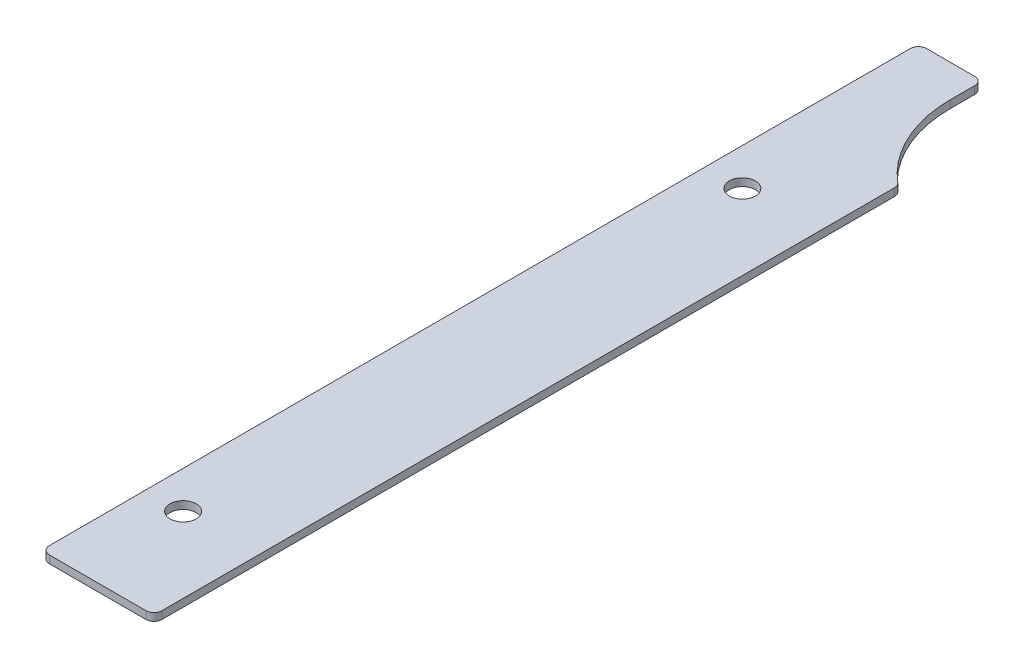
ISO-10303-21;
HEADER;
FILE_DESCRIPTION(('STEP AP214'),'2;1');
FILE_NAME('part.step','',(''),(''),'','','');
FILE_SCHEMA(('AUTOMOTIVE_DESIGN { 1 0 10303 214 1 1 1 1 }'));
ENDSEC;
DATA;
#1=APPLICATION_CONTEXT('core data for automotive mechanical design processes');
#2=APPLICATION_PROTOCOL_DEFINITION('international standard','automotive_design',2000,#1);
#3=PRODUCT_CONTEXT('',#1,'mechanical');
#4=PRODUCT('Part','Part','',(#3));
#5=PRODUCT_RELATED_PRODUCT_CATEGORY('part','',(#4));
#6=PRODUCT_DEFINITION_FORMATION('','',#4);
#7=PRODUCT_DEFINITION_CONTEXT('part definition',#1,'design');
#8=PRODUCT_DEFINITION('design','',#6,#7);
#9=PRODUCT_DEFINITION_SHAPE('','',#8);
#10=(LENGTH_UNIT() NAMED_UNIT(*) SI_UNIT(.MILLI.,.METRE.));
#11=(NAMED_UNIT(*) PLANE_ANGLE_UNIT() SI_UNIT($,.RADIAN.));
#12=(NAMED_UNIT(*) SI_UNIT($,.STERADIAN.) SOLID_ANGLE_UNIT());
#13=UNCERTAINTY_MEASURE_WITH_UNIT(LENGTH_MEASURE(1.E-05),#10,'distance_accuracy_value','');
#14=(GEOMETRIC_REPRESENTATION_CONTEXT(3) GLOBAL_UNCERTAINTY_ASSIGNED_CONTEXT((#13)) GLOBAL_UNIT_ASSIGNED_CONTEXT((#10,
#11,#12)) REPRESENTATION_CONTEXT('',''));
#15=CARTESIAN_POINT('',(0.,0.,0.));
#16=DIRECTION('',(0.,0.,1.));
#17=DIRECTION('',(1.,0.,0.));
#18=AXIS2_PLACEMENT_3D('',#15,#16,#17);
#19=CARTESIAN_POINT('',(-22.225,-3.0226,173.0375));
#20=DIRECTION('',(-1.,0.,0.));
#21=DIRECTION('',(0.,0.,1.));
#22=AXIS2_PLACEMENT_3D('',#19,#20,#21);
#23=PLANE('',#22);
#24=DIRECTION('',(0.,0.,1.));
#25=VECTOR('',#24,1.);
#26=CARTESIAN_POINT('',(-22.225,0.,173.0375));
#27=LINE('',#26,#25);
#28=CARTESIAN_POINT('',(-22.225,0.,-169.8625));
#29=VERTEX_POINT('',#28);
#30=CARTESIAN_POINT('',(-22.225,0.,169.8625));
#31=VERTEX_POINT('',#30);
#32=EDGE_CURVE('E206',#29,#31,#27,.T.);
#33=ORIENTED_EDGE('',*,*,#32,.F.);
#34=DIRECTION('',(0.,1.,0.));
#35=VECTOR('',#34,1.);
#36=CARTESIAN_POINT('',(-22.225,-3.0226,-169.8625));
#37=LINE('',#36,#35);
#38=CARTESIAN_POINT('',(-22.225,-3.0226,-169.8625));
#39=VERTEX_POINT('',#38);
#40=EDGE_CURVE('E63',#29,#39,#37,.F.);
#41=ORIENTED_EDGE('',*,*,#40,.T.);
#42=DIRECTION('',(0.,0.,1.));
#43=VECTOR('',#42,1.);
#44=CARTESIAN_POINT('',(-22.225,-3.0226,173.0375));
#45=LINE('',#44,#43);
#46=CARTESIAN_POINT('',(-22.225,-3.0226,169.8625));
#47=VERTEX_POINT('',#46);
#48=EDGE_CURVE('E215',#39,#47,#45,.T.);
#49=ORIENTED_EDGE('',*,*,#48,.T.);
#50=DIRECTION('',(0.,1.,0.));
#51=VECTOR('',#50,1.);
#52=CARTESIAN_POINT('',(-22.225,-3.0226,169.8625));
#53=LINE('',#52,#51);
#54=EDGE_CURVE('E179',#47,#31,#53,.T.);
#55=ORIENTED_EDGE('',*,*,#54,.T.);
#56=EDGE_LOOP('',(#33,#41,#49,#55));
#57=FACE_BOUND('',#56,.T.);
#58=ADVANCED_FACE('F41',(#57),#23,.T.);
#59=CARTESIAN_POINT('',(22.225,-3.0226,-173.0375));
#60=DIRECTION('',(0.,0.,-1.));
#61=DIRECTION('',(-1.,0.,0.));
#62=AXIS2_PLACEMENT_3D('',#59,#60,#61);
#63=PLANE('',#62);
#64=DIRECTION('',(-1.,0.,0.));
#65=VECTOR('',#64,1.);
#66=CARTESIAN_POINT('',(22.225,0.,-173.0375));
#67=LINE('',#66,#65);
#68=CARTESIAN_POINT('',(0.,0.,-173.0375));
#69=VERTEX_POINT('',#68);
#70=CARTESIAN_POINT('',(-19.05,0.,-173.0375));
#71=VERTEX_POINT('',#70);
#72=EDGE_CURVE('E208',#69,#71,#67,.T.);
#73=ORIENTED_EDGE('',*,*,#72,.F.);
#74=DIRECTION('',(0.,1.,0.));
#75=VECTOR('',#74,1.);
#76=CARTESIAN_POINT('',(0.,-3.0226,-173.0375));
#77=LINE('',#76,#75);
#78=CARTESIAN_POINT('',(0.,-3.0226,-173.0375));
#79=VERTEX_POINT('',#78);
#80=EDGE_CURVE('E169',#69,#79,#77,.F.);
#81=ORIENTED_EDGE('',*,*,#80,.T.);
#82=DIRECTION('',(-1.,0.,0.));
#83=VECTOR('',#82,1.);
#84=CARTESIAN_POINT('',(22.225,-3.0226,-173.0375));
#85=LINE('',#84,#83);
#86=CARTESIAN_POINT('',(-19.05,-3.0226,-173.0375));
#87=VERTEX_POINT('',#86);
#88=EDGE_CURVE('E138',#79,#87,#85,.T.);
#89=ORIENTED_EDGE('',*,*,#88,.T.);
#90=DIRECTION('',(0.,1.,0.));
#91=VECTOR('',#90,1.);
#92=CARTESIAN_POINT('',(-19.05,-3.0226,-173.0375));
#93=LINE('',#92,#91);
#94=EDGE_CURVE('E166',#87,#71,#93,.T.);
#95=ORIENTED_EDGE('',*,*,#94,.T.);
#96=EDGE_LOOP('',(#73,#81,#89,#95));
#97=FACE_BOUND('',#96,.T.);
#98=ADVANCED_FACE('F227',(#97),#63,.T.);
#99=CARTESIAN_POINT('',(22.225,-3.0226,173.0375));
#100=DIRECTION('',(1.,0.,0.));
#101=DIRECTION('',(0.,0.,-1.));
#102=AXIS2_PLACEMENT_3D('',#99,#100,#101);
#103=PLANE('',#102);
#104=DIRECTION('',(0.,0.,-1.));
#105=VECTOR('',#104,1.);
#106=CARTESIAN_POINT('',(22.225,-3.0226,173.0375));
#107=LINE('',#106,#105);
#108=CARTESIAN_POINT('',(22.225,-3.0226,169.8625));
#109=VERTEX_POINT('',#108);
#110=CARTESIAN_POINT('',(22.225,-3.0226,-119.15303385494));
#111=VERTEX_POINT('',#110);
#112=EDGE_CURVE('E219',#109,#111,#107,.T.);
#113=ORIENTED_EDGE('',*,*,#112,.T.);
#114=DIRECTION('',(0.,-1.,0.));
#115=VECTOR('',#114,1.);
#116=CARTESIAN_POINT('',(22.225,0.,-119.15303385494));
#117=LINE('',#116,#115);
#118=CARTESIAN_POINT('',(22.225,0.,-119.15303385494));
#119=VERTEX_POINT('',#118);
#120=EDGE_CURVE('E185',#111,#119,#117,.F.);
#121=ORIENTED_EDGE('',*,*,#120,.T.);
#122=DIRECTION('',(0.,0.,-1.));
#123=VECTOR('',#122,1.);
#124=CARTESIAN_POINT('',(22.225,0.,173.0375));
#125=LINE('',#124,#123);
#126=CARTESIAN_POINT('',(22.225,0.,169.8625));
#127=VERTEX_POINT('',#126);
#128=EDGE_CURVE('E205',#127,#119,#125,.T.);
#129=ORIENTED_EDGE('',*,*,#128,.F.);
#130=DIRECTION('',(0.,1.,0.));
#131=VECTOR('',#130,1.);
#132=CARTESIAN_POINT('',(22.225,-3.0226,169.8625));
#133=LINE('',#132,#131);
#134=EDGE_CURVE('E183',#127,#109,#133,.F.);
#135=ORIENTED_EDGE('',*,*,#134,.T.);
#136=EDGE_LOOP('',(#113,#121,#129,#135));
#137=FACE_BOUND('',#136,.T.);
#138=ADVANCED_FACE('F237',(#137),#103,.T.);
#139=CARTESIAN_POINT('',(22.225,-3.0226,173.0375));
#140=DIRECTION('',(0.,0.,1.));
#141=DIRECTION('',(1.,0.,0.));
#142=AXIS2_PLACEMENT_3D('',#139,#140,#141);
#143=PLANE('',#142);
#144=DIRECTION('',(1.,0.,0.));
#145=VECTOR('',#144,1.);
#146=CARTESIAN_POINT('',(22.225,0.,173.0375));
#147=LINE('',#146,#145);
#148=CARTESIAN_POINT('',(-19.05,0.,173.0375));
#149=VERTEX_POINT('',#148);
#150=CARTESIAN_POINT('',(19.05,0.,173.0375));
#151=VERTEX_POINT('',#150);
#152=EDGE_CURVE('E195',#149,#151,#147,.T.);
#153=ORIENTED_EDGE('',*,*,#152,.F.);
#154=DIRECTION('',(0.,1.,0.));
#155=VECTOR('',#154,1.);
#156=CARTESIAN_POINT('',(-19.05,-3.0226,173.0375));
#157=LINE('',#156,#155);
#158=CARTESIAN_POINT('',(-19.05,-3.0226,173.0375));
#159=VERTEX_POINT('',#158);
#160=EDGE_CURVE('E11',#149,#159,#157,.F.);
#161=ORIENTED_EDGE('',*,*,#160,.T.);
#162=DIRECTION('',(1.,0.,0.));
#163=VECTOR('',#162,1.);
#164=CARTESIAN_POINT('',(22.225,-3.0226,173.0375));
#165=LINE('',#164,#163);
#166=CARTESIAN_POINT('',(19.05,-3.0226,173.0375));
#167=VERTEX_POINT('',#166);
#168=EDGE_CURVE('E197',#159,#167,#165,.T.);
#169=ORIENTED_EDGE('',*,*,#168,.T.);
#170=DIRECTION('',(0.,1.,0.));
#171=VECTOR('',#170,1.);
#172=CARTESIAN_POINT('',(19.05,-3.0226,173.0375));
#173=LINE('',#172,#171);
#174=EDGE_CURVE('E49',#167,#151,#173,.T.);
#175=ORIENTED_EDGE('',*,*,#174,.T.);
#176=EDGE_LOOP('',(#153,#161,#169,#175));
#177=FACE_BOUND('',#176,.T.);
#178=ADVANCED_FACE('F194',(#177),#143,.T.);
#179=CARTESIAN_POINT('',(0.,-3.0226,0.));
#180=DIRECTION('',(0.,1.,0.));
#181=DIRECTION('',(0.,0.,1.));
#182=AXIS2_PLACEMENT_3D('',#179,#180,#181);
#183=PLANE('',#182);
#184=CARTESIAN_POINT('',(-7.54062500000001,-3.0226,131.7625));
#185=DIRECTION('',(0.,1.,0.));
#186=DIRECTION('',(0.,0.,1.));
#187=AXIS2_PLACEMENT_3D('',#184,#185,#186);
#188=CIRCLE('',#187,5.15937500000001);
#189=CARTESIAN_POINT('',(-7.54062500000001,-3.0226,136.921875));
#190=VERTEX_POINT('',#189);
#191=EDGE_CURVE('E210',#190,#190,#188,.F.);
#192=ORIENTED_EDGE('',*,*,#191,.F.);
#193=EDGE_LOOP('',(#192));
#194=FACE_BOUND('',#193,.T.);
#195=CARTESIAN_POINT('',(-7.54062500000001,-3.0226,-88.8999999999999));
#196=DIRECTION('',(0.,1.,0.));
#197=DIRECTION('',(0.,0.,1.));
#198=AXIS2_PLACEMENT_3D('',#195,#196,#197);
#199=CIRCLE('',#198,5.159375);
#200=CARTESIAN_POINT('',(-7.54062500000001,-3.0226,-83.740625));
#201=VERTEX_POINT('',#200);
#202=EDGE_CURVE('E268',#201,#201,#199,.F.);
#203=ORIENTED_EDGE('',*,*,#202,.F.);
#204=EDGE_LOOP('',(#203));
#205=FACE_BOUND('',#204,.T.);
#206=ORIENTED_EDGE('',*,*,#88,.F.);
#207=CARTESIAN_POINT('',(0.,-3.0226,-169.8625));
#208=DIRECTION('',(0.,1.,0.));
#209=DIRECTION('',(0.,0.,1.));
#210=AXIS2_PLACEMENT_3D('',#207,#208,#209);
#211=CIRCLE('',#210,3.175);
#212=CARTESIAN_POINT('',(3.17499999999999,-3.0226,-169.8625));
#213=VERTEX_POINT('',#212);
#214=EDGE_CURVE('E146',#79,#213,#211,.F.);
#215=ORIENTED_EDGE('',*,*,#214,.T.);
#216=DIRECTION('',(0.,0.,-1.));
#217=VECTOR('',#216,1.);
#218=CARTESIAN_POINT('',(3.17499999999999,-3.0226,-173.0375));
#219=LINE('',#218,#217);
#220=CARTESIAN_POINT('',(3.175,-3.0226,-160.30573728983));
#221=VERTEX_POINT('',#220);
#222=EDGE_CURVE('E130',#221,#213,#219,.T.);
#223=ORIENTED_EDGE('',*,*,#222,.F.);
#224=CARTESIAN_POINT('',(53.975,-3.0226,-160.30573728983));
#225=DIRECTION('',(0.,1.,0.));
#226=DIRECTION('',(0.,0.,1.));
#227=AXIS2_PLACEMENT_3D('',#224,#225,#226);
#228=CIRCLE('',#227,50.8);
#229=CARTESIAN_POINT('',(21.1044117647059,-3.0226,-121.573781115816));
#230=VERTEX_POINT('',#229);
#231=EDGE_CURVE('E143',#221,#230,#228,.T.);
#232=ORIENTED_EDGE('',*,*,#231,.T.);
#233=CARTESIAN_POINT('',(19.05,-3.0226,-119.15303385494));
#234=DIRECTION('',(0.,1.,0.));
#235=DIRECTION('',(0.,0.,1.));
#236=AXIS2_PLACEMENT_3D('',#233,#234,#235);
#237=CIRCLE('',#236,3.175);
#238=EDGE_CURVE('E174',#230,#111,#237,.F.);
#239=ORIENTED_EDGE('',*,*,#238,.T.);
#240=ORIENTED_EDGE('',*,*,#112,.F.);
#241=CARTESIAN_POINT('',(19.05,-3.0226,169.8625));
#242=DIRECTION('',(0.,1.,0.));
#243=DIRECTION('',(0.,0.,1.));
#244=AXIS2_PLACEMENT_3D('',#241,#242,#243);
#245=CIRCLE('',#244,3.175);
#246=EDGE_CURVE('E171',#109,#167,#245,.F.);
#247=ORIENTED_EDGE('',*,*,#246,.T.);
#248=ORIENTED_EDGE('',*,*,#168,.F.);
#249=CARTESIAN_POINT('',(-19.05,-3.0226,169.8625));
#250=DIRECTION('',(0.,1.,0.));
#251=DIRECTION('',(0.,0.,1.));
#252=AXIS2_PLACEMENT_3D('',#249,#250,#251);
#253=CIRCLE('',#252,3.175);
#254=EDGE_CURVE('E56',#159,#47,#253,.F.);
#255=ORIENTED_EDGE('',*,*,#254,.T.);
#256=ORIENTED_EDGE('',*,*,#48,.F.);
#257=CARTESIAN_POINT('',(-19.05,-3.0226,-169.8625));
#258=DIRECTION('',(0.,1.,0.));
#259=DIRECTION('',(0.,0.,1.));
#260=AXIS2_PLACEMENT_3D('',#257,#258,#259);
#261=CIRCLE('',#260,3.175);
#262=EDGE_CURVE('E176',#39,#87,#261,.F.);
#263=ORIENTED_EDGE('',*,*,#262,.T.);
#264=EDGE_LOOP('',(#206,#215,#223,#232,#239,#240,#247,#248,#255,#256,#263));
#265=FACE_BOUND('',#264,.T.);
#266=ADVANCED_FACE('F142',(#194,#205,#265),#183,.F.);
#267=CARTESIAN_POINT('',(0.,0.,0.));
#268=DIRECTION('',(0.,1.,0.));
#269=DIRECTION('',(0.,0.,1.));
#270=AXIS2_PLACEMENT_3D('',#267,#268,#269);
#271=PLANE('',#270);
#272=CARTESIAN_POINT('',(-7.54062500000001,0.,131.7625));
#273=DIRECTION('',(0.,1.,0.));
#274=DIRECTION('',(0.,0.,1.));
#275=AXIS2_PLACEMENT_3D('',#272,#273,#274);
#276=CIRCLE('',#275,5.15937500000001);
#277=CARTESIAN_POINT('',(-7.54062500000001,0.,136.921875));
#278=VERTEX_POINT('',#277);
#279=EDGE_CURVE('E273',#278,#278,#276,.T.);
#280=ORIENTED_EDGE('',*,*,#279,.F.);
#281=EDGE_LOOP('',(#280));
#282=FACE_BOUND('',#281,.T.);
#283=CARTESIAN_POINT('',(-7.54062500000001,0.,-88.8999999999999));
#284=DIRECTION('',(0.,1.,0.));
#285=DIRECTION('',(0.,0.,1.));
#286=AXIS2_PLACEMENT_3D('',#283,#284,#285);
#287=CIRCLE('',#286,5.159375);
#288=CARTESIAN_POINT('',(-7.54062500000001,0.,-83.740625));
#289=VERTEX_POINT('',#288);
#290=EDGE_CURVE('E266',#289,#289,#287,.T.);
#291=ORIENTED_EDGE('',*,*,#290,.F.);
#292=EDGE_LOOP('',(#291));
#293=FACE_BOUND('',#292,.T.);
#294=DIRECTION('',(0.,0.,1.));
#295=VECTOR('',#294,1.);
#296=CARTESIAN_POINT('',(3.17499999999999,0.,-173.0375));
#297=LINE('',#296,#295);
#298=CARTESIAN_POINT('',(3.17499999999999,0.,-169.8625));
#299=VERTEX_POINT('',#298);
#300=CARTESIAN_POINT('',(3.175,0.,-160.30573728983));
#301=VERTEX_POINT('',#300);
#302=EDGE_CURVE('E133',#299,#301,#297,.T.);
#303=ORIENTED_EDGE('',*,*,#302,.F.);
#304=CARTESIAN_POINT('',(0.,0.,-169.8625));
#305=DIRECTION('',(0.,1.,0.));
#306=DIRECTION('',(0.,0.,1.));
#307=AXIS2_PLACEMENT_3D('',#304,#305,#306);
#308=CIRCLE('',#307,3.175);
#309=EDGE_CURVE('E164',#299,#69,#308,.T.);
#310=ORIENTED_EDGE('',*,*,#309,.T.);
#311=ORIENTED_EDGE('',*,*,#72,.T.);
#312=CARTESIAN_POINT('',(-19.05,0.,-169.8625));
#313=DIRECTION('',(0.,1.,0.));
#314=DIRECTION('',(0.,0.,1.));
#315=AXIS2_PLACEMENT_3D('',#312,#313,#314);
#316=CIRCLE('',#315,3.175);
#317=EDGE_CURVE('E162',#71,#29,#316,.T.);
#318=ORIENTED_EDGE('',*,*,#317,.T.);
#319=ORIENTED_EDGE('',*,*,#32,.T.);
#320=CARTESIAN_POINT('',(-19.05,0.,169.8625));
#321=DIRECTION('',(0.,1.,0.));
#322=DIRECTION('',(0.,0.,1.));
#323=AXIS2_PLACEMENT_3D('',#320,#321,#322);
#324=CIRCLE('',#323,3.175);
#325=EDGE_CURVE('E158',#31,#149,#324,.T.);
#326=ORIENTED_EDGE('',*,*,#325,.T.);
#327=ORIENTED_EDGE('',*,*,#152,.T.);
#328=CARTESIAN_POINT('',(19.05,0.,169.8625));
#329=DIRECTION('',(0.,1.,0.));
#330=DIRECTION('',(0.,0.,1.));
#331=AXIS2_PLACEMENT_3D('',#328,#329,#330);
#332=CIRCLE('',#331,3.175);
#333=EDGE_CURVE('E153',#151,#127,#332,.T.);
#334=ORIENTED_EDGE('',*,*,#333,.T.);
#335=ORIENTED_EDGE('',*,*,#128,.T.);
#336=CARTESIAN_POINT('',(19.05,0.,-119.15303385494));
#337=DIRECTION('',(0.,1.,0.));
#338=DIRECTION('',(0.,0.,1.));
#339=AXIS2_PLACEMENT_3D('',#336,#337,#338);
#340=CIRCLE('',#339,3.175);
#341=CARTESIAN_POINT('',(21.1044117647059,0.,-121.573781115816));
#342=VERTEX_POINT('',#341);
#343=EDGE_CURVE('E160',#119,#342,#340,.T.);
#344=ORIENTED_EDGE('',*,*,#343,.T.);
#345=CARTESIAN_POINT('',(53.975,0.,-160.30573728983));
#346=DIRECTION('',(0.,1.,0.));
#347=DIRECTION('',(0.,0.,1.));
#348=AXIS2_PLACEMENT_3D('',#345,#346,#347);
#349=CIRCLE('',#348,50.8);
#350=EDGE_CURVE('E137',#342,#301,#349,.F.);
#351=ORIENTED_EDGE('',*,*,#350,.T.);
#352=EDGE_LOOP('',(#303,#310,#311,#318,#319,#326,#327,#334,#335,#344,#351));
#353=FACE_BOUND('',#352,.T.);
#354=ADVANCED_FACE('F201',(#282,#293,#353),#271,.T.);
#355=CARTESIAN_POINT('',(3.17499999999999,-3.0236,-173.0375));
#356=DIRECTION('',(-1.,0.,0.));
#357=DIRECTION('',(0.,0.,1.));
#358=AXIS2_PLACEMENT_3D('',#355,#356,#357);
#359=PLANE('',#358);
#360=ORIENTED_EDGE('',*,*,#222,.T.);
#361=DIRECTION('',(0.,1.,0.));
#362=VECTOR('',#361,1.);
#363=CARTESIAN_POINT('',(3.17499999999999,0.,-169.8625));
#364=LINE('',#363,#362);
#365=EDGE_CURVE('E151',#213,#299,#364,.T.);
#366=ORIENTED_EDGE('',*,*,#365,.T.);
#367=ORIENTED_EDGE('',*,*,#302,.T.);
#368=DIRECTION('',(0.,1.,0.));
#369=VECTOR('',#368,1.);
#370=CARTESIAN_POINT('',(3.175,-3.0236,-160.30573728983));
#371=LINE('',#370,#369);
#372=EDGE_CURVE('E126',#301,#221,#371,.F.);
#373=ORIENTED_EDGE('',*,*,#372,.T.);
#374=EDGE_LOOP('',(#360,#366,#367,#373));
#375=FACE_BOUND('',#374,.T.);
#376=ADVANCED_FACE('F128',(#375),#359,.F.);
#377=CARTESIAN_POINT('',(-7.54062500000001,-3.0236,-88.8999999999999));
#378=DIRECTION('',(0.,1.,0.));
#379=DIRECTION('',(0.,0.,1.));
#380=AXIS2_PLACEMENT_3D('',#377,#378,#379);
#381=CYLINDRICAL_SURFACE('',#380,5.159375);
#382=ORIENTED_EDGE('',*,*,#290,.T.);
#383=EDGE_LOOP('',(#382));
#384=FACE_BOUND('',#383,.T.);
#385=ORIENTED_EDGE('',*,*,#202,.T.);
#386=EDGE_LOOP('',(#385));
#387=FACE_BOUND('',#386,.T.);
#388=ADVANCED_FACE('F290',(#384,#387),#381,.F.);
#389=CARTESIAN_POINT('',(-7.54062500000001,-3.0236,131.7625));
#390=DIRECTION('',(0.,1.,0.));
#391=DIRECTION('',(0.,0.,1.));
#392=AXIS2_PLACEMENT_3D('',#389,#390,#391);
#393=CYLINDRICAL_SURFACE('',#392,5.15937500000001);
#394=ORIENTED_EDGE('',*,*,#279,.T.);
#395=EDGE_LOOP('',(#394));
#396=FACE_BOUND('',#395,.T.);
#397=ORIENTED_EDGE('',*,*,#191,.T.);
#398=EDGE_LOOP('',(#397));
#399=FACE_BOUND('',#398,.T.);
#400=ADVANCED_FACE('F261',(#396,#399),#393,.F.);
#401=CARTESIAN_POINT('',(53.975,-3.0236,-160.30573728983));
#402=DIRECTION('',(0.,1.,0.));
#403=DIRECTION('',(0.,0.,1.));
#404=AXIS2_PLACEMENT_3D('',#401,#402,#403);
#405=CYLINDRICAL_SURFACE('',#404,50.8);
#406=ORIENTED_EDGE('',*,*,#350,.F.);
#407=DIRECTION('',(0.,1.,0.));
#408=VECTOR('',#407,1.);
#409=CARTESIAN_POINT('',(21.1044117647059,-3.0236,-121.573781115816));
#410=LINE('',#409,#408);
#411=EDGE_CURVE('E150',#342,#230,#410,.F.);
#412=ORIENTED_EDGE('',*,*,#411,.T.);
#413=ORIENTED_EDGE('',*,*,#231,.F.);
#414=ORIENTED_EDGE('',*,*,#372,.F.);
#415=EDGE_LOOP('',(#406,#412,#413,#414));
#416=FACE_BOUND('',#415,.T.);
#417=ADVANCED_FACE('F148',(#416),#405,.F.);
#418=CARTESIAN_POINT('',(0.,-3.0236,-169.8625));
#419=DIRECTION('',(0.,-1.,0.));
#420=DIRECTION('',(0.,0.,-1.));
#421=AXIS2_PLACEMENT_3D('',#418,#419,#420);
#422=CYLINDRICAL_SURFACE('',#421,3.175);
#423=ORIENTED_EDGE('',*,*,#214,.F.);
#424=ORIENTED_EDGE('',*,*,#80,.F.);
#425=ORIENTED_EDGE('',*,*,#309,.F.);
#426=ORIENTED_EDGE('',*,*,#365,.F.);
#427=EDGE_LOOP('',(#423,#424,#425,#426));
#428=FACE_BOUND('',#427,.T.);
#429=ADVANCED_FACE('F247',(#428),#422,.T.);
#430=CARTESIAN_POINT('',(-19.05,-3.0226,-169.8625));
#431=DIRECTION('',(0.,1.,0.));
#432=DIRECTION('',(0.,0.,1.));
#433=AXIS2_PLACEMENT_3D('',#430,#431,#432);
#434=CYLINDRICAL_SURFACE('',#433,3.175);
#435=ORIENTED_EDGE('',*,*,#262,.F.);
#436=ORIENTED_EDGE('',*,*,#40,.F.);
#437=ORIENTED_EDGE('',*,*,#317,.F.);
#438=ORIENTED_EDGE('',*,*,#94,.F.);
#439=EDGE_LOOP('',(#435,#436,#437,#438));
#440=FACE_BOUND('',#439,.T.);
#441=ADVANCED_FACE('F231',(#440),#434,.T.);
#442=CARTESIAN_POINT('',(19.05,-3.0236,-119.15303385494));
#443=DIRECTION('',(0.,1.,0.));
#444=DIRECTION('',(0.,0.,1.));
#445=AXIS2_PLACEMENT_3D('',#442,#443,#444);
#446=CYLINDRICAL_SURFACE('',#445,3.175);
#447=ORIENTED_EDGE('',*,*,#238,.F.);
#448=ORIENTED_EDGE('',*,*,#411,.F.);
#449=ORIENTED_EDGE('',*,*,#343,.F.);
#450=ORIENTED_EDGE('',*,*,#120,.F.);
#451=EDGE_LOOP('',(#447,#448,#449,#450));
#452=FACE_BOUND('',#451,.T.);
#453=ADVANCED_FACE('F240',(#452),#446,.T.);
#454=CARTESIAN_POINT('',(-19.05,-3.0226,169.8625));
#455=DIRECTION('',(0.,1.,0.));
#456=DIRECTION('',(0.,0.,1.));
#457=AXIS2_PLACEMENT_3D('',#454,#455,#456);
#458=CYLINDRICAL_SURFACE('',#457,3.175);
#459=ORIENTED_EDGE('',*,*,#254,.F.);
#460=ORIENTED_EDGE('',*,*,#160,.F.);
#461=ORIENTED_EDGE('',*,*,#325,.F.);
#462=ORIENTED_EDGE('',*,*,#54,.F.);
#463=EDGE_LOOP('',(#459,#460,#461,#462));
#464=FACE_BOUND('',#463,.T.);
#465=ADVANCED_FACE('F233',(#464),#458,.T.);
#466=CARTESIAN_POINT('',(19.05,-3.0226,169.8625));
#467=DIRECTION('',(0.,1.,0.));
#468=DIRECTION('',(0.,0.,1.));
#469=AXIS2_PLACEMENT_3D('',#466,#467,#468);
#470=CYLINDRICAL_SURFACE('',#469,3.175);
#471=ORIENTED_EDGE('',*,*,#246,.F.);
#472=ORIENTED_EDGE('',*,*,#134,.F.);
#473=ORIENTED_EDGE('',*,*,#333,.F.);
#474=ORIENTED_EDGE('',*,*,#174,.F.);
#475=EDGE_LOOP('',(#471,#472,#473,#474));
#476=FACE_BOUND('',#475,.T.);
#477=ADVANCED_FACE('F43',(#476),#470,.T.);
#478=CLOSED_SHELL('',(#58,#98,#138,#178,#266,#354,#376,#388,#400,#417,#429,#441,#453,#465,#477));
#479=MANIFOLD_SOLID_BREP('B2',#478);
#480=ADVANCED_BREP_SHAPE_REPRESENTATION('',(#18,#479),#14);
#481=SHAPE_DEFINITION_REPRESENTATION(#9,#480);
ENDSEC;
END-ISO-10303-21;
